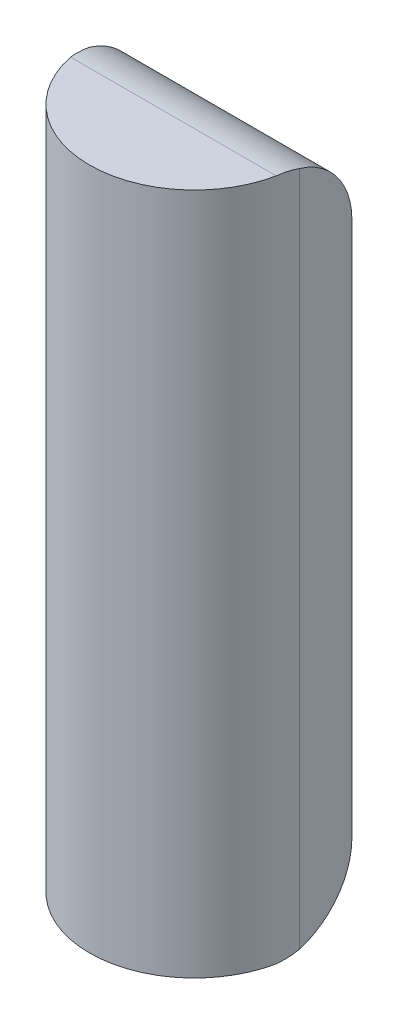
ISO-10303-21;
HEADER;
FILE_DESCRIPTION(('STEP AP214'),'2;1');
FILE_NAME('part.step','',(''),(''),'','','');
FILE_SCHEMA(('AUTOMOTIVE_DESIGN { 1 0 10303 214 1 1 1 1 }'));
ENDSEC;
DATA;
#1=APPLICATION_CONTEXT('core data for automotive mechanical design processes');
#2=APPLICATION_PROTOCOL_DEFINITION('international standard','automotive_design',2000,#1);
#3=PRODUCT_CONTEXT('',#1,'mechanical');
#4=PRODUCT('Part','Part','',(#3));
#5=PRODUCT_RELATED_PRODUCT_CATEGORY('part','',(#4));
#6=PRODUCT_DEFINITION_FORMATION('','',#4);
#7=PRODUCT_DEFINITION_CONTEXT('part definition',#1,'design');
#8=PRODUCT_DEFINITION('design','',#6,#7);
#9=PRODUCT_DEFINITION_SHAPE('','',#8);
#10=(LENGTH_UNIT() NAMED_UNIT(*) SI_UNIT(.MILLI.,.METRE.));
#11=(NAMED_UNIT(*) PLANE_ANGLE_UNIT() SI_UNIT($,.RADIAN.));
#12=(NAMED_UNIT(*) SI_UNIT($,.STERADIAN.) SOLID_ANGLE_UNIT());
#13=UNCERTAINTY_MEASURE_WITH_UNIT(LENGTH_MEASURE(1.E-05),#10,'distance_accuracy_value','');
#14=(GEOMETRIC_REPRESENTATION_CONTEXT(3) GLOBAL_UNCERTAINTY_ASSIGNED_CONTEXT((#13)) GLOBAL_UNIT_ASSIGNED_CONTEXT((#10,
#11,#12)) REPRESENTATION_CONTEXT('',''));
#15=CARTESIAN_POINT('',(0.,0.,0.));
#16=DIRECTION('',(0.,0.,1.));
#17=DIRECTION('',(1.,0.,0.));
#18=AXIS2_PLACEMENT_3D('',#15,#16,#17);
#19=CARTESIAN_POINT('',(-0.2,0.,-0.35));
#20=DIRECTION('',(0.,1.,0.));
#21=DIRECTION('',(0.,0.,1.));
#22=AXIS2_PLACEMENT_3D('',#19,#20,#21);
#23=CYLINDRICAL_SURFACE('',#22,0.1);
#24=CARTESIAN_POINT('',(-0.2,0.,-0.35));
#25=DIRECTION('',(0.,1.,0.));
#26=DIRECTION('',(0.,0.,1.));
#27=AXIS2_PLACEMENT_3D('',#24,#25,#26);
#28=CIRCLE('',#27,0.1);
#29=CARTESIAN_POINT('',(-0.297979589711327,0.,-0.33));
#30=VERTEX_POINT('',#29);
#31=CARTESIAN_POINT('',(-0.102020410288672,0.,-0.33));
#32=VERTEX_POINT('',#31);
#33=EDGE_CURVE('E11',#30,#32,#28,.T.);
#34=ORIENTED_EDGE('',*,*,#33,.T.);
#35=CARTESIAN_POINT('',(-0.0999999999999996,0.00291796067500545,-0.349999999999997));
#36=CARTESIAN_POINT('',(-0.100084183762028,0.00267649394960232,-0.349190121189793));
#37=CARTESIAN_POINT('',(-0.100168367524056,0.00244970743001093,-0.348375866058584));
#38=CARTESIAN_POINT('',(-0.100336735048112,0.00202576163123393,-0.34673967912913));
#39=CARTESIAN_POINT('',(-0.10042091881014,0.00182860235204831,-0.345917747330885));
#40=CARTESIAN_POINT('',(-0.100589286334196,0.00146417786286507,-0.344267283042332));
#41=CARTESIAN_POINT('',(-0.100673470096224,0.00129691265286746,-0.343438750552023));
#42=CARTESIAN_POINT('',(-0.10084183762028,0.00099249345546182,-0.341776172212152));
#43=CARTESIAN_POINT('',(-0.100926021382308,0.000855339468053793,-0.340942126362589));
#44=CARTESIAN_POINT('',(-0.101094388906364,0.000611323369011899,-0.339269615138349));
#45=CARTESIAN_POINT('',(-0.101178572668392,0.000504461257378031,-0.338431149763672));
#46=CARTESIAN_POINT('',(-0.101346940192448,0.000321168311295587,-0.336750899341898));
#47=CARTESIAN_POINT('',(-0.101431123954476,0.000244737476847012,-0.3359091142948));
#48=CARTESIAN_POINT('',(-0.101599491478532,0.000122409650322977,-0.334223328579187));
#49=CARTESIAN_POINT('',(-0.10168367524056,7.65126582475187E-05,-0.333379327910672));
#50=CARTESIAN_POINT('',(-0.101852042764616,1.53042319068211E-05,-0.331690218311812));
#51=CARTESIAN_POINT('',(-0.101936226526644,-7.20235841860914E-09,-0.330845109381467));
#52=CARTESIAN_POINT('',(-0.102020410288672,0.,-0.33));
#53=B_SPLINE_CURVE_WITH_KNOTS('',3,(#35,#36,#37,#38,#39,#40,#41,#42,#43,#44,#45,#46,#47,#48,#49,
#50,#51,#52),.UNSPECIFIED.,.F.,.F.,(4,2,2,2,2,2,2,2,4),(0.,0.00254773712594263,
0.0050954742518852,0.00764321137782785,0.0101909485037705,0.012738685629713,0.0152864227556555,
0.0178341598815982,0.0203818970075408),.UNSPECIFIED.);
#54=CARTESIAN_POINT('',(-0.0999999999999996,0.00291796067500627,-0.35));
#55=VERTEX_POINT('',#54);
#56=EDGE_CURVE('E25',#55,#32,#53,.T.);
#57=ORIENTED_EDGE('',*,*,#56,.F.);
#58=DIRECTION('',(0.,1.,0.));
#59=VECTOR('',#58,1.);
#60=CARTESIAN_POINT('',(-0.0999999999999996,0.,-0.35));
#61=LINE('',#60,#59);
#62=CARTESIAN_POINT('',(-0.0999999999999996,0.647082039324994,-0.35));
#63=VERTEX_POINT('',#62);
#64=EDGE_CURVE('E73',#55,#63,#61,.T.);
#65=ORIENTED_EDGE('',*,*,#64,.T.);
#66=CARTESIAN_POINT('',(-0.102020410288672,0.65,-0.33));
#67=CARTESIAN_POINT('',(-0.101936226526644,0.650000007202358,-0.330845109381467));
#68=CARTESIAN_POINT('',(-0.101852042764616,0.649984695768093,-0.331690218311812));
#69=CARTESIAN_POINT('',(-0.10168367524056,0.649923487341753,-0.333379327910672));
#70=CARTESIAN_POINT('',(-0.101599491478532,0.649877590349677,-0.334223328579187));
#71=CARTESIAN_POINT('',(-0.101431123954476,0.649755262523153,-0.3359091142948));
#72=CARTESIAN_POINT('',(-0.101346940192448,0.649678831688704,-0.336750899341898));
#73=CARTESIAN_POINT('',(-0.101178572668392,0.649495538742622,-0.338431149763672));
#74=CARTESIAN_POINT('',(-0.101094388906364,0.649388676630988,-0.339269615138349));
#75=CARTESIAN_POINT('',(-0.100926021382308,0.649144660531946,-0.340942126362589));
#76=CARTESIAN_POINT('',(-0.10084183762028,0.649007506544538,-0.341776172212152));
#77=CARTESIAN_POINT('',(-0.100673470096224,0.648703087347132,-0.343438750552023));
#78=CARTESIAN_POINT('',(-0.100589286334196,0.648535822137135,-0.344267283042332));
#79=CARTESIAN_POINT('',(-0.10042091881014,0.648171397647952,-0.345917747330885));
#80=CARTESIAN_POINT('',(-0.100336735048112,0.647974238368766,-0.34673967912913));
#81=CARTESIAN_POINT('',(-0.100168367524056,0.647550292569989,-0.348375866058584));
#82=CARTESIAN_POINT('',(-0.100084183762028,0.647323506050398,-0.349190121189793));
#83=CARTESIAN_POINT('',(-0.0999999999999996,0.647082039324995,-0.349999999999997));
#84=B_SPLINE_CURVE_WITH_KNOTS('',3,(#66,#67,#68,#69,#70,#71,#72,#73,#74,#75,#76,#77,#78,#79,#80,
#81,#82,#83),.UNSPECIFIED.,.F.,.F.,(4,2,2,2,2,2,2,2,4),(0.,0.0025477371259426,
0.00509547425188523,0.00764321137782783,0.0101909485037704,0.012738685629713,0.0152864227556556,
0.0178341598815983,0.0203818970075409),.UNSPECIFIED.);
#85=CARTESIAN_POINT('',(-0.102020410288672,0.65,-0.33));
#86=VERTEX_POINT('',#85);
#87=EDGE_CURVE('E198',#86,#63,#84,.T.);
#88=ORIENTED_EDGE('',*,*,#87,.F.);
#89=CARTESIAN_POINT('',(-0.2,0.65,-0.35));
#90=DIRECTION('',(0.,1.,0.));
#91=DIRECTION('',(0.,0.,1.));
#92=AXIS2_PLACEMENT_3D('',#89,#90,#91);
#93=CIRCLE('',#92,0.1);
#94=CARTESIAN_POINT('',(-0.297979589711327,0.65,-0.33));
#95=VERTEX_POINT('',#94);
#96=EDGE_CURVE('E208',#95,#86,#93,.T.);
#97=ORIENTED_EDGE('',*,*,#96,.F.);
#98=CARTESIAN_POINT('',(-0.3,0.647082039324995,-0.349999999999997));
#99=CARTESIAN_POINT('',(-0.299915816237972,0.647323506050398,-0.349190121189793));
#100=CARTESIAN_POINT('',(-0.299831632475944,0.647550292569989,-0.348375866058584));
#101=CARTESIAN_POINT('',(-0.299663264951888,0.647974238368766,-0.34673967912913));
#102=CARTESIAN_POINT('',(-0.29957908118986,0.648171397647952,-0.345917747330885));
#103=CARTESIAN_POINT('',(-0.299410713665804,0.648535822137135,-0.344267283042332));
#104=CARTESIAN_POINT('',(-0.299326529903776,0.648703087347132,-0.343438750552023));
#105=CARTESIAN_POINT('',(-0.29915816237972,0.649007506544538,-0.341776172212152));
#106=CARTESIAN_POINT('',(-0.299073978617692,0.649144660531946,-0.340942126362589));
#107=CARTESIAN_POINT('',(-0.298905611093635,0.649388676630988,-0.339269615138349));
#108=CARTESIAN_POINT('',(-0.298821427331607,0.649495538742622,-0.338431149763672));
#109=CARTESIAN_POINT('',(-0.298653059807551,0.649678831688704,-0.336750899341898));
#110=CARTESIAN_POINT('',(-0.298568876045523,0.649755262523153,-0.3359091142948));
#111=CARTESIAN_POINT('',(-0.298400508521467,0.649877590349677,-0.334223328579187));
#112=CARTESIAN_POINT('',(-0.298316324759439,0.649923487341753,-0.333379327910672));
#113=CARTESIAN_POINT('',(-0.298147957235383,0.649984695768093,-0.331690218311812));
#114=CARTESIAN_POINT('',(-0.298063773473355,0.650000007202358,-0.330845109381467));
#115=CARTESIAN_POINT('',(-0.297979589711327,0.65,-0.33));
#116=B_SPLINE_CURVE_WITH_KNOTS('',3,(#98,#99,#100,#101,#102,#103,#104,#105,#106,#107,#108,#109,
#110,#111,#112,#113,#114,#115),.UNSPECIFIED.,.F.,.F.,(4,2,2,2,2,2,2,2,4),(0.,0.0025477371259426,
0.00509547425188528,0.00764321137782788,0.0101909485037705,0.0127386856297131,
0.0152864227556557,0.0178341598815983,0.020381897007541),.UNSPECIFIED.);
#117=CARTESIAN_POINT('',(-0.3,0.647082039324994,-0.35));
#118=VERTEX_POINT('',#117);
#119=EDGE_CURVE('E210',#118,#95,#116,.T.);
#120=ORIENTED_EDGE('',*,*,#119,.F.);
#121=DIRECTION('',(0.,1.,0.));
#122=VECTOR('',#121,1.);
#123=CARTESIAN_POINT('',(-0.3,0.,-0.35));
#124=LINE('',#123,#122);
#125=CARTESIAN_POINT('',(-0.3,0.00291796067500541,-0.349999999999999));
#126=VERTEX_POINT('',#125);
#127=EDGE_CURVE('E214',#126,#118,#124,.T.);
#128=ORIENTED_EDGE('',*,*,#127,.F.);
#129=CARTESIAN_POINT('',(-0.2979795897113,0.,-0.33));
#130=CARTESIAN_POINT('',(-0.298063773473329,-7.20235840989913E-09,-0.330845109381467));
#131=CARTESIAN_POINT('',(-0.298147957235358,1.5304231906827E-05,-0.331690218311812));
#132=CARTESIAN_POINT('',(-0.298316324759417,7.65126582475114E-05,-0.333379327910672));
#133=CARTESIAN_POINT('',(-0.298400508521446,0.000122409650322958,-0.334223328579187));
#134=CARTESIAN_POINT('',(-0.298568876045504,0.000244737476846978,-0.335909114294799));
#135=CARTESIAN_POINT('',(-0.298653059807533,0.000321168311295552,-0.336750899341897));
#136=CARTESIAN_POINT('',(-0.298821427331592,0.000504461257377991,-0.338431149763672));
#137=CARTESIAN_POINT('',(-0.298905611093621,0.000611323369011857,-0.339269615138349));
#138=CARTESIAN_POINT('',(-0.299073978617679,0.000855339468053722,-0.340942126362589));
#139=CARTESIAN_POINT('',(-0.299158162379708,0.000992493455461722,-0.341776172212152));
#140=CARTESIAN_POINT('',(-0.299326529903767,0.00129691265286734,-0.343438750552023));
#141=CARTESIAN_POINT('',(-0.299410713665796,0.00146417786286495,-0.344267283042331));
#142=CARTESIAN_POINT('',(-0.299579081189854,0.00182860235204816,-0.345917747330884));
#143=CARTESIAN_POINT('',(-0.299663264951884,0.00202576163123375,-0.346739679129129));
#144=CARTESIAN_POINT('',(-0.299831632475942,0.0024497074300107,-0.348375866058583));
#145=CARTESIAN_POINT('',(-0.299915816237971,0.00267649394960205,-0.349190121189792));
#146=CARTESIAN_POINT('',(-0.3,0.00291796067500516,-0.349999999999996));
#147=B_SPLINE_CURVE_WITH_KNOTS('',3,(#129,#130,#131,#132,#133,#134,#135,#136,#137,#138,#139,
#140,#141,#142,#143,#144,#145,#146),.UNSPECIFIED.,.F.,.F.,(4,2,2,2,2,2,2,2,4),(0.,
0.00254773712594285,0.00509547425188561,0.00764321137782838,0.0101909485037712,
0.012738685629714,0.0152864227556569,0.0178341598815997,0.0203818970075425),.UNSPECIFIED.);
#148=EDGE_CURVE('E117',#30,#126,#147,.T.);
#149=ORIENTED_EDGE('',*,*,#148,.F.);
#150=EDGE_LOOP('',(#34,#57,#65,#88,#97,#120,#128,#149));
#151=FACE_BOUND('',#150,.T.);
#152=ADVANCED_FACE('F17',(#151),#23,.T.);
#153=CARTESIAN_POINT('',(-0.3,0.,-0.4));
#154=DIRECTION('',(-1.,0.,0.));
#155=DIRECTION('',(0.,0.,1.));
#156=AXIS2_PLACEMENT_3D('',#153,#154,#155);
#157=PLANE('',#156);
#158=CARTESIAN_POINT('',(-0.3,0.58,-0.33));
#159=DIRECTION('',(1.,0.,0.));
#160=DIRECTION('',(0.,0.,1.));
#161=AXIS2_PLACEMENT_3D('',#158,#159,#160);
#162=CIRCLE('',#161,0.07);
#163=CARTESIAN_POINT('',(-0.3,0.58,-0.4));
#164=VERTEX_POINT('',#163);
#165=EDGE_CURVE('E112',#164,#118,#162,.T.);
#166=ORIENTED_EDGE('',*,*,#165,.F.);
#167=DIRECTION('',(0.,1.,0.));
#168=VECTOR('',#167,1.);
#169=CARTESIAN_POINT('',(-0.3,0.,-0.4));
#170=LINE('',#169,#168);
#171=CARTESIAN_POINT('',(-0.3,0.07,-0.4));
#172=VERTEX_POINT('',#171);
#173=EDGE_CURVE('E110',#172,#164,#170,.T.);
#174=ORIENTED_EDGE('',*,*,#173,.F.);
#175=CARTESIAN_POINT('',(-0.3,0.07,-0.33));
#176=DIRECTION('',(1.,0.,0.));
#177=DIRECTION('',(0.,0.,1.));
#178=AXIS2_PLACEMENT_3D('',#175,#176,#177);
#179=CIRCLE('',#178,0.07);
#180=EDGE_CURVE('E90',#126,#172,#179,.T.);
#181=ORIENTED_EDGE('',*,*,#180,.F.);
#182=ORIENTED_EDGE('',*,*,#127,.T.);
#183=EDGE_LOOP('',(#166,#174,#181,#182));
#184=FACE_BOUND('',#183,.T.);
#185=ADVANCED_FACE('F165',(#184),#157,.T.);
#186=CARTESIAN_POINT('',(-0.0999999999999996,0.,-0.35));
#187=DIRECTION('',(1.,0.,0.));
#188=DIRECTION('',(0.,0.,-1.));
#189=AXIS2_PLACEMENT_3D('',#186,#187,#188);
#190=PLANE('',#189);
#191=CARTESIAN_POINT('',(-0.0999999999999995,0.58,-0.33));
#192=DIRECTION('',(-1.,0.,0.));
#193=DIRECTION('',(0.,0.,-1.));
#194=AXIS2_PLACEMENT_3D('',#191,#192,#193);
#195=CIRCLE('',#194,0.07);
#196=CARTESIAN_POINT('',(-0.0999999999999998,0.58,-0.4));
#197=VERTEX_POINT('',#196);
#198=EDGE_CURVE('E76',#63,#197,#195,.T.);
#199=ORIENTED_EDGE('',*,*,#198,.F.);
#200=ORIENTED_EDGE('',*,*,#64,.F.);
#201=CARTESIAN_POINT('',(-0.0999999999999995,0.07,-0.33));
#202=DIRECTION('',(-1.,0.,0.));
#203=DIRECTION('',(0.,0.,-1.));
#204=AXIS2_PLACEMENT_3D('',#201,#202,#203);
#205=CIRCLE('',#204,0.07);
#206=CARTESIAN_POINT('',(-0.0999999999999998,0.07,-0.4));
#207=VERTEX_POINT('',#206);
#208=EDGE_CURVE('E67',#207,#55,#205,.T.);
#209=ORIENTED_EDGE('',*,*,#208,.F.);
#210=DIRECTION('',(0.,1.,0.));
#211=VECTOR('',#210,1.);
#212=CARTESIAN_POINT('',(-0.0999999999999998,0.,-0.4));
#213=LINE('',#212,#211);
#214=EDGE_CURVE('E71',#207,#197,#213,.T.);
#215=ORIENTED_EDGE('',*,*,#214,.T.);
#216=EDGE_LOOP('',(#199,#200,#209,#215));
#217=FACE_BOUND('',#216,.T.);
#218=ADVANCED_FACE('F70',(#217),#190,.T.);
#219=CARTESIAN_POINT('',(0.,0.58,-0.33));
#220=DIRECTION('',(1.,0.,0.));
#221=DIRECTION('',(0.,0.,-1.));
#222=AXIS2_PLACEMENT_3D('',#219,#220,#221);
#223=CYLINDRICAL_SURFACE('',#222,0.07);
#224=DIRECTION('',(1.,0.,0.));
#225=VECTOR('',#224,1.);
#226=CARTESIAN_POINT('',(0.8,0.58,-0.4));
#227=LINE('',#226,#225);
#228=EDGE_CURVE('E84',#164,#197,#227,.T.);
#229=ORIENTED_EDGE('',*,*,#228,.F.);
#230=ORIENTED_EDGE('',*,*,#165,.T.);
#231=ORIENTED_EDGE('',*,*,#119,.T.);
#232=DIRECTION('',(-1.,0.,0.));
#233=VECTOR('',#232,1.);
#234=CARTESIAN_POINT('',(-0.8,0.65,-0.33));
#235=LINE('',#234,#233);
#236=EDGE_CURVE('E91',#86,#95,#235,.T.);
#237=ORIENTED_EDGE('',*,*,#236,.F.);
#238=ORIENTED_EDGE('',*,*,#87,.T.);
#239=ORIENTED_EDGE('',*,*,#198,.T.);
#240=EDGE_LOOP('',(#229,#230,#231,#237,#238,#239));
#241=FACE_BOUND('',#240,.T.);
#242=ADVANCED_FACE('F173',(#241),#223,.T.);
#243=CARTESIAN_POINT('',(0.,0.65,0.));
#244=DIRECTION('',(0.,1.,0.));
#245=DIRECTION('',(0.,0.,1.));
#246=AXIS2_PLACEMENT_3D('',#243,#244,#245);
#247=PLANE('',#246);
#248=ORIENTED_EDGE('',*,*,#236,.T.);
#249=ORIENTED_EDGE('',*,*,#96,.T.);
#250=EDGE_LOOP('',(#248,#249));
#251=FACE_BOUND('',#250,.T.);
#252=ADVANCED_FACE('F143',(#251),#247,.T.);
#253=CARTESIAN_POINT('',(0.8,0.07,-0.33));
#254=DIRECTION('',(-1.,0.,0.));
#255=DIRECTION('',(0.,0.,1.));
#256=AXIS2_PLACEMENT_3D('',#253,#254,#255);
#257=CYLINDRICAL_SURFACE('',#256,0.07);
#258=ORIENTED_EDGE('',*,*,#148,.T.);
#259=ORIENTED_EDGE('',*,*,#180,.T.);
#260=DIRECTION('',(-1.,0.,0.));
#261=VECTOR('',#260,1.);
#262=CARTESIAN_POINT('',(0.8,0.07,-0.4));
#263=LINE('',#262,#261);
#264=EDGE_CURVE('E82',#207,#172,#263,.T.);
#265=ORIENTED_EDGE('',*,*,#264,.F.);
#266=ORIENTED_EDGE('',*,*,#208,.T.);
#267=ORIENTED_EDGE('',*,*,#56,.T.);
#268=DIRECTION('',(1.,0.,0.));
#269=VECTOR('',#268,1.);
#270=CARTESIAN_POINT('',(0.,0.,-0.33));
#271=LINE('',#270,#269);
#272=EDGE_CURVE('E92',#30,#32,#271,.T.);
#273=ORIENTED_EDGE('',*,*,#272,.F.);
#274=EDGE_LOOP('',(#258,#259,#265,#266,#267,#273));
#275=FACE_BOUND('',#274,.T.);
#276=ADVANCED_FACE('F88',(#275),#257,.T.);
#277=CARTESIAN_POINT('',(0.,0.,0.));
#278=DIRECTION('',(0.,1.,0.));
#279=DIRECTION('',(0.,0.,1.));
#280=AXIS2_PLACEMENT_3D('',#277,#278,#279);
#281=PLANE('',#280);
#282=ORIENTED_EDGE('',*,*,#33,.F.);
#283=ORIENTED_EDGE('',*,*,#272,.T.);
#284=EDGE_LOOP('',(#282,#283));
#285=FACE_BOUND('',#284,.T.);
#286=ADVANCED_FACE('F142',(#285),#281,.F.);
#287=CARTESIAN_POINT('',(0.8,0.65,-0.4));
#288=DIRECTION('',(0.,0.,1.));
#289=DIRECTION('',(1.,0.,0.));
#290=AXIS2_PLACEMENT_3D('',#287,#288,#289);
#291=PLANE('',#290);
#292=ORIENTED_EDGE('',*,*,#214,.F.);
#293=ORIENTED_EDGE('',*,*,#264,.T.);
#294=ORIENTED_EDGE('',*,*,#173,.T.);
#295=ORIENTED_EDGE('',*,*,#228,.T.);
#296=EDGE_LOOP('',(#292,#293,#294,#295));
#297=FACE_BOUND('',#296,.T.);
#298=ADVANCED_FACE('F80',(#297),#291,.F.);
#299=CLOSED_SHELL('',(#152,#185,#218,#242,#252,#276,#286,#298));
#300=MANIFOLD_SOLID_BREP('B1',#299);
#301=ADVANCED_BREP_SHAPE_REPRESENTATION('',(#18,#300),#14);
#302=SHAPE_DEFINITION_REPRESENTATION(#9,#301);
ENDSEC;
END-ISO-10303-21;
